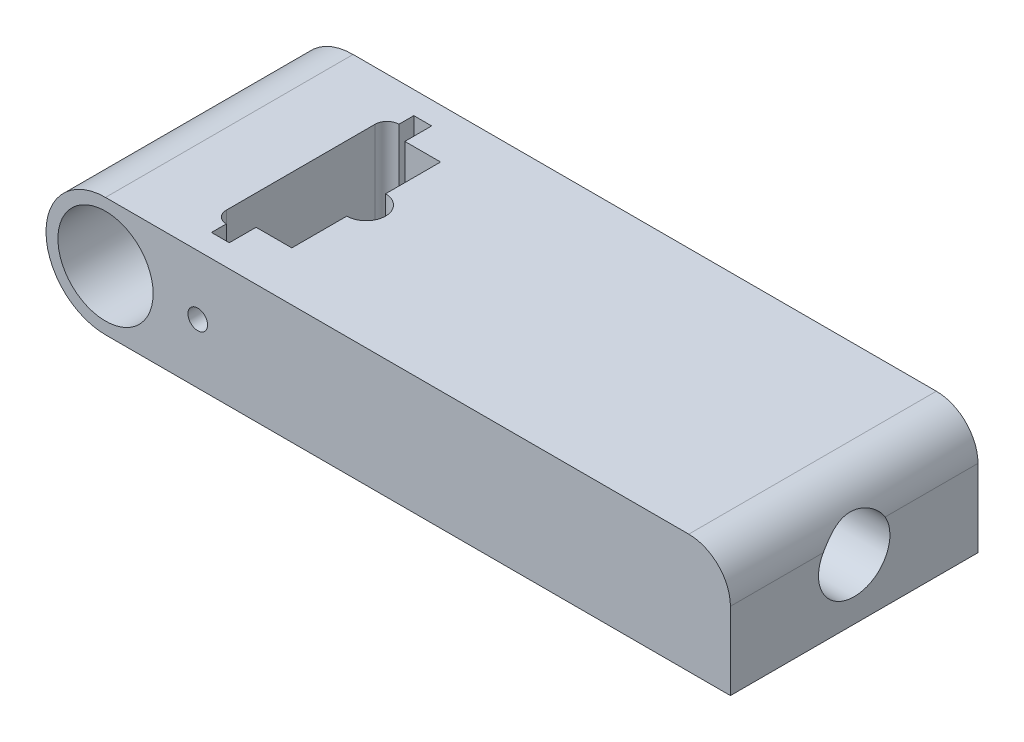
ISO-10303-21;
HEADER;
FILE_DESCRIPTION(('STEP AP214'),'2;1');
FILE_NAME('part.step','',(''),(''),'','','');
FILE_SCHEMA(('AUTOMOTIVE_DESIGN { 1 0 10303 214 1 1 1 1 }'));
ENDSEC;
DATA;
#1=APPLICATION_CONTEXT('core data for automotive mechanical design processes');
#2=APPLICATION_PROTOCOL_DEFINITION('international standard','automotive_design',2000,#1);
#3=PRODUCT_CONTEXT('',#1,'mechanical');
#4=PRODUCT('Part','Part','',(#3));
#5=PRODUCT_RELATED_PRODUCT_CATEGORY('part','',(#4));
#6=PRODUCT_DEFINITION_FORMATION('','',#4);
#7=PRODUCT_DEFINITION_CONTEXT('part definition',#1,'design');
#8=PRODUCT_DEFINITION('design','',#6,#7);
#9=PRODUCT_DEFINITION_SHAPE('','',#8);
#10=(LENGTH_UNIT() NAMED_UNIT(*) SI_UNIT(.MILLI.,.METRE.));
#11=(NAMED_UNIT(*) PLANE_ANGLE_UNIT() SI_UNIT($,.RADIAN.));
#12=(NAMED_UNIT(*) SI_UNIT($,.STERADIAN.) SOLID_ANGLE_UNIT());
#13=UNCERTAINTY_MEASURE_WITH_UNIT(LENGTH_MEASURE(1.E-05),#10,'distance_accuracy_value','');
#14=(GEOMETRIC_REPRESENTATION_CONTEXT(3) GLOBAL_UNCERTAINTY_ASSIGNED_CONTEXT((#13)) GLOBAL_UNIT_ASSIGNED_CONTEXT((#10,
#11,#12)) REPRESENTATION_CONTEXT('',''));
#15=CARTESIAN_POINT('',(0.,0.,0.));
#16=DIRECTION('',(0.,0.,1.));
#17=DIRECTION('',(1.,0.,0.));
#18=AXIS2_PLACEMENT_3D('',#15,#16,#17);
#19=CARTESIAN_POINT('',(14.,-10.,-17.));
#20=DIRECTION('',(0.,0.,-1.));
#21=DIRECTION('',(-1.,0.,0.));
#22=AXIS2_PLACEMENT_3D('',#19,#20,#21);
#23=PLANE('',#22);
#24=DIRECTION('',(0.,1.,0.));
#25=VECTOR('',#24,1.);
#26=CARTESIAN_POINT('',(14.,-10.,-17.));
#27=LINE('',#26,#25);
#28=CARTESIAN_POINT('',(14.,0.687386354243315,-17.));
#29=VERTEX_POINT('',#28);
#30=CARTESIAN_POINT('',(14.,10.,-17.));
#31=VERTEX_POINT('',#30);
#32=EDGE_CURVE('E403',#29,#31,#27,.T.);
#33=ORIENTED_EDGE('',*,*,#32,.F.);
#34=CARTESIAN_POINT('',(15.5,0.,-17.));
#35=DIRECTION('',(0.,0.,-1.));
#36=DIRECTION('',(-1.,0.,0.));
#37=AXIS2_PLACEMENT_3D('',#34,#35,#36);
#38=CIRCLE('',#37,1.64999999999999);
#39=CARTESIAN_POINT('',(17.,0.687386354243375,-17.));
#40=VERTEX_POINT('',#39);
#41=EDGE_CURVE('E404',#29,#40,#38,.T.);
#42=ORIENTED_EDGE('',*,*,#41,.T.);
#43=DIRECTION('',(0.,1.,0.));
#44=VECTOR('',#43,1.);
#45=CARTESIAN_POINT('',(17.,-10.,-17.));
#46=LINE('',#45,#44);
#47=CARTESIAN_POINT('',(17.,10.,-17.));
#48=VERTEX_POINT('',#47);
#49=EDGE_CURVE('E417',#40,#48,#46,.T.);
#50=ORIENTED_EDGE('',*,*,#49,.T.);
#51=DIRECTION('',(-1.,0.,0.));
#52=VECTOR('',#51,1.);
#53=CARTESIAN_POINT('',(14.,10.,-17.));
#54=LINE('',#53,#52);
#55=EDGE_CURVE('E407',#48,#31,#54,.T.);
#56=ORIENTED_EDGE('',*,*,#55,.T.);
#57=EDGE_LOOP('',(#33,#42,#50,#56));
#58=FACE_BOUND('',#57,.T.);
#59=ADVANCED_FACE('F38',(#58),#23,.F.);
#60=CARTESIAN_POINT('',(17.,-10.,-17.));
#61=DIRECTION('',(1.,0.,0.));
#62=DIRECTION('',(0.,0.,-1.));
#63=AXIS2_PLACEMENT_3D('',#60,#61,#62);
#64=PLANE('',#63);
#65=DIRECTION('',(0.,1.,0.));
#66=VECTOR('',#65,1.);
#67=CARTESIAN_POINT('',(17.,-10.,-12.5));
#68=LINE('',#67,#66);
#69=CARTESIAN_POINT('',(17.,-10.,-12.5));
#70=VERTEX_POINT('',#69);
#71=CARTESIAN_POINT('',(17.,-0.687386354243375,-12.5));
#72=VERTEX_POINT('',#71);
#73=EDGE_CURVE('E423',#70,#72,#68,.T.);
#74=ORIENTED_EDGE('',*,*,#73,.T.);
#75=DIRECTION('',(0.,0.,-1.));
#76=VECTOR('',#75,1.);
#77=CARTESIAN_POINT('',(17.,-0.687386354243375,-20.8));
#78=LINE('',#77,#76);
#79=CARTESIAN_POINT('',(17.,-0.687386354243375,-17.));
#80=VERTEX_POINT('',#79);
#81=EDGE_CURVE('E802',#72,#80,#78,.T.);
#82=ORIENTED_EDGE('',*,*,#81,.T.);
#83=CARTESIAN_POINT('',(17.,-10.,-17.));
#84=VERTEX_POINT('',#83);
#85=EDGE_CURVE('E412',#84,#80,#46,.T.);
#86=ORIENTED_EDGE('',*,*,#85,.F.);
#87=DIRECTION('',(0.,0.,-1.));
#88=VECTOR('',#87,1.);
#89=CARTESIAN_POINT('',(17.,-10.,-17.));
#90=LINE('',#89,#88);
#91=EDGE_CURVE('E510',#70,#84,#90,.T.);
#92=ORIENTED_EDGE('',*,*,#91,.F.);
#93=EDGE_LOOP('',(#74,#82,#86,#92));
#94=FACE_BOUND('',#93,.T.);
#95=ADVANCED_FACE('F361',(#94),#64,.F.);
#96=CARTESIAN_POINT('',(0.,0.,-20.8));
#97=DIRECTION('',(0.,0.,1.));
#98=DIRECTION('',(1.,0.,0.));
#99=AXIS2_PLACEMENT_3D('',#96,#97,#98);
#100=PLANE('',#99);
#101=DIRECTION('',(-1.,0.,0.));
#102=VECTOR('',#101,1.);
#103=CARTESIAN_POINT('',(0.,10.,-20.8));
#104=LINE('',#103,#102);
#105=CARTESIAN_POINT('',(98.,10.,-20.8));
#106=VERTEX_POINT('',#105);
#107=CARTESIAN_POINT('',(0.,10.,-20.8));
#108=VERTEX_POINT('',#107);
#109=EDGE_CURVE('E272',#106,#108,#104,.T.);
#110=ORIENTED_EDGE('',*,*,#109,.F.);
#111=CARTESIAN_POINT('',(98.,3.,-20.8));
#112=DIRECTION('',(0.,0.,1.));
#113=DIRECTION('',(1.,0.,0.));
#114=AXIS2_PLACEMENT_3D('',#111,#112,#113);
#115=CIRCLE('',#114,7.);
#116=CARTESIAN_POINT('',(105.,3.,-20.8));
#117=VERTEX_POINT('',#116);
#118=EDGE_CURVE('E299',#106,#117,#115,.F.);
#119=ORIENTED_EDGE('',*,*,#118,.T.);
#120=DIRECTION('',(0.,1.,0.));
#121=VECTOR('',#120,1.);
#122=CARTESIAN_POINT('',(105.,10.,-20.8));
#123=LINE('',#122,#121);
#124=CARTESIAN_POINT('',(105.,-10.,-20.8));
#125=VERTEX_POINT('',#124);
#126=EDGE_CURVE('E284',#125,#117,#123,.T.);
#127=ORIENTED_EDGE('',*,*,#126,.F.);
#128=DIRECTION('',(1.,0.,0.));
#129=VECTOR('',#128,1.);
#130=CARTESIAN_POINT('',(0.,-10.,-20.8));
#131=LINE('',#130,#129);
#132=CARTESIAN_POINT('',(0.,-10.,-20.8));
#133=VERTEX_POINT('',#132);
#134=EDGE_CURVE('E282',#133,#125,#131,.T.);
#135=ORIENTED_EDGE('',*,*,#134,.F.);
#136=CARTESIAN_POINT('',(0.,0.,-20.8));
#137=DIRECTION('',(0.,0.,1.));
#138=DIRECTION('',(1.,0.,0.));
#139=AXIS2_PLACEMENT_3D('',#136,#137,#138);
#140=CIRCLE('',#139,10.);
#141=EDGE_CURVE('E265',#108,#133,#140,.T.);
#142=ORIENTED_EDGE('',*,*,#141,.F.);
#143=EDGE_LOOP('',(#110,#119,#127,#135,#142));
#144=FACE_BOUND('',#143,.T.);
#145=CARTESIAN_POINT('',(0.,0.,-20.8));
#146=DIRECTION('',(0.,0.,1.));
#147=DIRECTION('',(1.,0.,0.));
#148=AXIS2_PLACEMENT_3D('',#145,#146,#147);
#149=CIRCLE('',#148,8.);
#150=CARTESIAN_POINT('',(8.,0.,-20.8));
#151=VERTEX_POINT('',#150);
#152=EDGE_CURVE('E260',#151,#151,#149,.T.);
#153=ORIENTED_EDGE('',*,*,#152,.T.);
#154=EDGE_LOOP('',(#153));
#155=FACE_BOUND('',#154,.T.);
#156=CARTESIAN_POINT('',(15.5,0.,-20.8));
#157=DIRECTION('',(0.,0.,-1.));
#158=DIRECTION('',(-1.,0.,0.));
#159=AXIS2_PLACEMENT_3D('',#156,#157,#158);
#160=CIRCLE('',#159,1.64999999999999);
#161=CARTESIAN_POINT('',(13.85,0.,-20.8));
#162=VERTEX_POINT('',#161);
#163=EDGE_CURVE('E777',#162,#162,#160,.T.);
#164=ORIENTED_EDGE('',*,*,#163,.F.);
#165=EDGE_LOOP('',(#164));
#166=FACE_BOUND('',#165,.T.);
#167=ADVANCED_FACE('F398',(#144,#155,#166),#100,.F.);
#168=CARTESIAN_POINT('',(17.,-10.,17.));
#169=DIRECTION('',(1.,0.,0.));
#170=DIRECTION('',(0.,0.,-1.));
#171=AXIS2_PLACEMENT_3D('',#168,#169,#170);
#172=PLANE('',#171);
#173=DIRECTION('',(0.,1.,0.));
#174=VECTOR('',#173,1.);
#175=CARTESIAN_POINT('',(17.,-10.,17.));
#176=LINE('',#175,#174);
#177=CARTESIAN_POINT('',(17.,-10.,17.));
#178=VERTEX_POINT('',#177);
#179=CARTESIAN_POINT('',(17.,-0.687386354243375,17.));
#180=VERTEX_POINT('',#179);
#181=EDGE_CURVE('E435',#178,#180,#176,.T.);
#182=ORIENTED_EDGE('',*,*,#181,.T.);
#183=DIRECTION('',(0.,0.,-1.));
#184=VECTOR('',#183,1.);
#185=CARTESIAN_POINT('',(17.,-0.687386354243375,-20.8));
#186=LINE('',#185,#184);
#187=CARTESIAN_POINT('',(17.,-0.687386354243375,12.5));
#188=VERTEX_POINT('',#187);
#189=EDGE_CURVE('E789',#180,#188,#186,.T.);
#190=ORIENTED_EDGE('',*,*,#189,.T.);
#191=DIRECTION('',(0.,1.,0.));
#192=VECTOR('',#191,1.);
#193=CARTESIAN_POINT('',(17.,-10.,12.5));
#194=LINE('',#193,#192);
#195=CARTESIAN_POINT('',(17.,-10.,12.5));
#196=VERTEX_POINT('',#195);
#197=EDGE_CURVE('E432',#196,#188,#194,.T.);
#198=ORIENTED_EDGE('',*,*,#197,.F.);
#199=DIRECTION('',(0.,0.,-1.));
#200=VECTOR('',#199,1.);
#201=CARTESIAN_POINT('',(17.,-10.,17.));
#202=LINE('',#201,#200);
#203=EDGE_CURVE('E498',#178,#196,#202,.T.);
#204=ORIENTED_EDGE('',*,*,#203,.F.);
#205=EDGE_LOOP('',(#182,#190,#198,#204));
#206=FACE_BOUND('',#205,.T.);
#207=ADVANCED_FACE('F378',(#206),#172,.F.);
#208=CARTESIAN_POINT('',(14.,-10.,-14.5));
#209=DIRECTION('',(-1.,0.,0.));
#210=DIRECTION('',(0.,0.,1.));
#211=AXIS2_PLACEMENT_3D('',#208,#209,#210);
#212=PLANE('',#211);
#213=DIRECTION('',(0.,1.,0.));
#214=VECTOR('',#213,1.);
#215=CARTESIAN_POINT('',(14.,-10.,-14.5));
#216=LINE('',#215,#214);
#217=CARTESIAN_POINT('',(14.,0.687386354243315,-14.5));
#218=VERTEX_POINT('',#217);
#219=CARTESIAN_POINT('',(14.,10.,-14.5));
#220=VERTEX_POINT('',#219);
#221=EDGE_CURVE('E415',#218,#220,#216,.T.);
#222=ORIENTED_EDGE('',*,*,#221,.F.);
#223=DIRECTION('',(0.,0.,-1.));
#224=VECTOR('',#223,1.);
#225=CARTESIAN_POINT('',(14.,0.687386354243315,-20.8));
#226=LINE('',#225,#224);
#227=EDGE_CURVE('E59',#218,#29,#226,.T.);
#228=ORIENTED_EDGE('',*,*,#227,.T.);
#229=ORIENTED_EDGE('',*,*,#32,.T.);
#230=DIRECTION('',(0.,0.,1.));
#231=VECTOR('',#230,1.);
#232=CARTESIAN_POINT('',(14.,10.,-14.5));
#233=LINE('',#232,#231);
#234=EDGE_CURVE('E478',#31,#220,#233,.T.);
#235=ORIENTED_EDGE('',*,*,#234,.T.);
#236=EDGE_LOOP('',(#222,#228,#229,#235));
#237=FACE_BOUND('',#236,.T.);
#238=ADVANCED_FACE('F352',(#237),#212,.F.);
#239=CARTESIAN_POINT('',(14.,-10.,17.));
#240=DIRECTION('',(0.,0.,1.));
#241=DIRECTION('',(1.,0.,0.));
#242=AXIS2_PLACEMENT_3D('',#239,#240,#241);
#243=PLANE('',#242);
#244=CARTESIAN_POINT('',(17.,0.687386354243375,17.));
#245=VERTEX_POINT('',#244);
#246=CARTESIAN_POINT('',(17.,10.,17.));
#247=VERTEX_POINT('',#246);
#248=EDGE_CURVE('E437',#245,#247,#176,.T.);
#249=ORIENTED_EDGE('',*,*,#248,.F.);
#250=CARTESIAN_POINT('',(15.5,0.,17.));
#251=DIRECTION('',(0.,0.,1.));
#252=DIRECTION('',(1.,0.,0.));
#253=AXIS2_PLACEMENT_3D('',#250,#251,#252);
#254=CIRCLE('',#253,1.64999999999999);
#255=CARTESIAN_POINT('',(14.,0.687386354243315,17.));
#256=VERTEX_POINT('',#255);
#257=EDGE_CURVE('E452',#245,#256,#254,.T.);
#258=ORIENTED_EDGE('',*,*,#257,.T.);
#259=DIRECTION('',(0.,1.,0.));
#260=VECTOR('',#259,1.);
#261=CARTESIAN_POINT('',(14.,-10.,17.));
#262=LINE('',#261,#260);
#263=CARTESIAN_POINT('',(14.,10.,17.));
#264=VERTEX_POINT('',#263);
#265=EDGE_CURVE('E238',#256,#264,#262,.T.);
#266=ORIENTED_EDGE('',*,*,#265,.T.);
#267=DIRECTION('',(1.,0.,0.));
#268=VECTOR('',#267,1.);
#269=CARTESIAN_POINT('',(14.,10.,17.));
#270=LINE('',#269,#268);
#271=EDGE_CURVE('E450',#264,#247,#270,.T.);
#272=ORIENTED_EDGE('',*,*,#271,.T.);
#273=EDGE_LOOP('',(#249,#258,#266,#272));
#274=FACE_BOUND('',#273,.T.);
#275=ADVANCED_FACE('F383',(#274),#243,.F.);
#276=CARTESIAN_POINT('',(14.,-10.,14.5));
#277=DIRECTION('',(-1.,0.,0.));
#278=DIRECTION('',(0.,0.,1.));
#279=AXIS2_PLACEMENT_3D('',#276,#277,#278);
#280=PLANE('',#279);
#281=ORIENTED_EDGE('',*,*,#265,.F.);
#282=DIRECTION('',(0.,0.,-1.));
#283=VECTOR('',#282,1.);
#284=CARTESIAN_POINT('',(14.,0.687386354243315,-20.8));
#285=LINE('',#284,#283);
#286=CARTESIAN_POINT('',(14.,0.687386354243315,14.5));
#287=VERTEX_POINT('',#286);
#288=EDGE_CURVE('E227',#256,#287,#285,.T.);
#289=ORIENTED_EDGE('',*,*,#288,.T.);
#290=DIRECTION('',(0.,1.,0.));
#291=VECTOR('',#290,1.);
#292=CARTESIAN_POINT('',(14.,-10.,14.5));
#293=LINE('',#292,#291);
#294=CARTESIAN_POINT('',(14.,10.,14.5));
#295=VERTEX_POINT('',#294);
#296=EDGE_CURVE('E236',#287,#295,#293,.T.);
#297=ORIENTED_EDGE('',*,*,#296,.T.);
#298=DIRECTION('',(0.,0.,1.));
#299=VECTOR('',#298,1.);
#300=CARTESIAN_POINT('',(14.,10.,14.5));
#301=LINE('',#300,#299);
#302=EDGE_CURVE('E453',#295,#264,#301,.T.);
#303=ORIENTED_EDGE('',*,*,#302,.T.);
#304=EDGE_LOOP('',(#281,#289,#297,#303));
#305=FACE_BOUND('',#304,.T.);
#306=ADVANCED_FACE('F234',(#305),#280,.F.);
#307=CARTESIAN_POINT('',(0.,0.,20.8));
#308=DIRECTION('',(0.,0.,1.));
#309=DIRECTION('',(1.,0.,0.));
#310=AXIS2_PLACEMENT_3D('',#307,#308,#309);
#311=PLANE('',#310);
#312=CARTESIAN_POINT('',(15.5,0.,20.8));
#313=DIRECTION('',(0.,0.,-1.));
#314=DIRECTION('',(-1.,0.,0.));
#315=AXIS2_PLACEMENT_3D('',#312,#313,#314);
#316=CIRCLE('',#315,1.64999999999999);
#317=CARTESIAN_POINT('',(13.85,0.,20.8));
#318=VERTEX_POINT('',#317);
#319=EDGE_CURVE('E778',#318,#318,#316,.T.);
#320=ORIENTED_EDGE('',*,*,#319,.T.);
#321=EDGE_LOOP('',(#320));
#322=FACE_BOUND('',#321,.T.);
#323=DIRECTION('',(0.,1.,0.));
#324=VECTOR('',#323,1.);
#325=CARTESIAN_POINT('',(105.,10.,20.8));
#326=LINE('',#325,#324);
#327=CARTESIAN_POINT('',(105.,-10.,20.8));
#328=VERTEX_POINT('',#327);
#329=CARTESIAN_POINT('',(105.,3.,20.8));
#330=VERTEX_POINT('',#329);
#331=EDGE_CURVE('E274',#328,#330,#326,.T.);
#332=ORIENTED_EDGE('',*,*,#331,.T.);
#333=CARTESIAN_POINT('',(98.,3.,20.8));
#334=DIRECTION('',(0.,0.,1.));
#335=DIRECTION('',(1.,0.,0.));
#336=AXIS2_PLACEMENT_3D('',#333,#334,#335);
#337=CIRCLE('',#336,7.);
#338=CARTESIAN_POINT('',(98.,10.,20.8));
#339=VERTEX_POINT('',#338);
#340=EDGE_CURVE('E311',#330,#339,#337,.T.);
#341=ORIENTED_EDGE('',*,*,#340,.T.);
#342=DIRECTION('',(-1.,0.,0.));
#343=VECTOR('',#342,1.);
#344=CARTESIAN_POINT('',(0.,10.,20.8));
#345=LINE('',#344,#343);
#346=CARTESIAN_POINT('',(0.,10.,20.8));
#347=VERTEX_POINT('',#346);
#348=EDGE_CURVE('E277',#339,#347,#345,.T.);
#349=ORIENTED_EDGE('',*,*,#348,.T.);
#350=CARTESIAN_POINT('',(0.,0.,20.8));
#351=DIRECTION('',(0.,0.,1.));
#352=DIRECTION('',(1.,0.,0.));
#353=AXIS2_PLACEMENT_3D('',#350,#351,#352);
#354=CIRCLE('',#353,10.);
#355=CARTESIAN_POINT('',(0.,-10.,20.8));
#356=VERTEX_POINT('',#355);
#357=EDGE_CURVE('E268',#347,#356,#354,.T.);
#358=ORIENTED_EDGE('',*,*,#357,.T.);
#359=DIRECTION('',(1.,0.,0.));
#360=VECTOR('',#359,1.);
#361=CARTESIAN_POINT('',(0.,-10.,20.8));
#362=LINE('',#361,#360);
#363=EDGE_CURVE('E271',#356,#328,#362,.T.);
#364=ORIENTED_EDGE('',*,*,#363,.T.);
#365=EDGE_LOOP('',(#332,#341,#349,#358,#364));
#366=FACE_BOUND('',#365,.T.);
#367=CARTESIAN_POINT('',(0.,0.,20.8));
#368=DIRECTION('',(0.,0.,1.));
#369=DIRECTION('',(1.,0.,0.));
#370=AXIS2_PLACEMENT_3D('',#367,#368,#369);
#371=CIRCLE('',#370,8.);
#372=CARTESIAN_POINT('',(8.,0.,20.8));
#373=VERTEX_POINT('',#372);
#374=EDGE_CURVE('E262',#373,#373,#371,.T.);
#375=ORIENTED_EDGE('',*,*,#374,.F.);
#376=EDGE_LOOP('',(#375));
#377=FACE_BOUND('',#376,.T.);
#378=ADVANCED_FACE('F555',(#322,#366,#377),#311,.T.);
#379=CARTESIAN_POINT('',(0.,0.,20.8));
#380=DIRECTION('',(0.,0.,-1.));
#381=DIRECTION('',(-1.,0.,0.));
#382=AXIS2_PLACEMENT_3D('',#379,#380,#381);
#383=CYLINDRICAL_SURFACE('',#382,10.);
#384=ORIENTED_EDGE('',*,*,#141,.T.);
#385=DIRECTION('',(0.,0.,-1.));
#386=VECTOR('',#385,1.);
#387=CARTESIAN_POINT('',(0.,-10.,20.8));
#388=LINE('',#387,#386);
#389=EDGE_CURVE('E293',#356,#133,#388,.T.);
#390=ORIENTED_EDGE('',*,*,#389,.F.);
#391=ORIENTED_EDGE('',*,*,#357,.F.);
#392=DIRECTION('',(0.,0.,-1.));
#393=VECTOR('',#392,1.);
#394=CARTESIAN_POINT('',(0.,10.,20.8));
#395=LINE('',#394,#393);
#396=EDGE_CURVE('E279',#347,#108,#395,.T.);
#397=ORIENTED_EDGE('',*,*,#396,.T.);
#398=EDGE_LOOP('',(#384,#390,#391,#397));
#399=FACE_BOUND('',#398,.T.);
#400=ADVANCED_FACE('F568',(#399),#383,.T.);
#401=CARTESIAN_POINT('',(0.,-10.,20.8));
#402=DIRECTION('',(0.,1.,0.));
#403=DIRECTION('',(0.,0.,1.));
#404=AXIS2_PLACEMENT_3D('',#401,#402,#403);
#405=PLANE('',#404);
#406=DIRECTION('',(0.,0.,1.));
#407=VECTOR('',#406,1.);
#408=CARTESIAN_POINT('',(14.,-10.,-14.5));
#409=LINE('',#408,#407);
#410=CARTESIAN_POINT('',(14.,-10.,-17.));
#411=VERTEX_POINT('',#410);
#412=CARTESIAN_POINT('',(14.,-10.,-14.5));
#413=VERTEX_POINT('',#412);
#414=EDGE_CURVE('E256',#411,#413,#409,.T.);
#415=ORIENTED_EDGE('',*,*,#414,.T.);
#416=CARTESIAN_POINT('',(14.,-10.,-12.5));
#417=DIRECTION('',(0.,1.,0.));
#418=DIRECTION('',(0.,0.,-1.));
#419=AXIS2_PLACEMENT_3D('',#416,#417,#418);
#420=CIRCLE('',#419,2.);
#421=CARTESIAN_POINT('',(12.,-10.,-12.5));
#422=VERTEX_POINT('',#421);
#423=EDGE_CURVE('E337',#413,#422,#420,.T.);
#424=ORIENTED_EDGE('',*,*,#423,.T.);
#425=DIRECTION('',(0.,0.,1.));
#426=VECTOR('',#425,1.);
#427=CARTESIAN_POINT('',(12.,-10.,12.5));
#428=LINE('',#427,#426);
#429=CARTESIAN_POINT('',(12.,-10.,12.5));
#430=VERTEX_POINT('',#429);
#431=EDGE_CURVE('E482',#422,#430,#428,.T.);
#432=ORIENTED_EDGE('',*,*,#431,.T.);
#433=CARTESIAN_POINT('',(14.,-10.,12.5));
#434=DIRECTION('',(0.,1.,0.));
#435=DIRECTION('',(0.,0.,1.));
#436=AXIS2_PLACEMENT_3D('',#433,#434,#435);
#437=CIRCLE('',#436,2.);
#438=CARTESIAN_POINT('',(14.,-10.,14.5));
#439=VERTEX_POINT('',#438);
#440=EDGE_CURVE('E487',#430,#439,#437,.T.);
#441=ORIENTED_EDGE('',*,*,#440,.T.);
#442=DIRECTION('',(0.,0.,1.));
#443=VECTOR('',#442,1.);
#444=CARTESIAN_POINT('',(14.,-10.,14.5));
#445=LINE('',#444,#443);
#446=CARTESIAN_POINT('',(14.,-10.,17.));
#447=VERTEX_POINT('',#446);
#448=EDGE_CURVE('E490',#439,#447,#445,.T.);
#449=ORIENTED_EDGE('',*,*,#448,.T.);
#450=DIRECTION('',(1.,0.,0.));
#451=VECTOR('',#450,1.);
#452=CARTESIAN_POINT('',(14.,-10.,17.));
#453=LINE('',#452,#451);
#454=EDGE_CURVE('E495',#447,#178,#453,.T.);
#455=ORIENTED_EDGE('',*,*,#454,.T.);
#456=ORIENTED_EDGE('',*,*,#203,.T.);
#457=DIRECTION('',(1.,0.,0.));
#458=VECTOR('',#457,1.);
#459=CARTESIAN_POINT('',(17.,-10.,12.5));
#460=LINE('',#459,#458);
#461=CARTESIAN_POINT('',(23.,-10.,12.5));
#462=VERTEX_POINT('',#461);
#463=EDGE_CURVE('E501',#196,#462,#460,.T.);
#464=ORIENTED_EDGE('',*,*,#463,.T.);
#465=DIRECTION('',(0.,0.,-1.));
#466=VECTOR('',#465,1.);
#467=CARTESIAN_POINT('',(23.,-10.,-12.5));
#468=LINE('',#467,#466);
#469=CARTESIAN_POINT('',(23.,-10.,-12.5));
#470=VERTEX_POINT('',#469);
#471=EDGE_CURVE('E504',#462,#470,#468,.T.);
#472=ORIENTED_EDGE('',*,*,#471,.T.);
#473=DIRECTION('',(-1.,0.,0.));
#474=VECTOR('',#473,1.);
#475=CARTESIAN_POINT('',(17.,-10.,-12.5));
#476=LINE('',#475,#474);
#477=EDGE_CURVE('E507',#470,#70,#476,.T.);
#478=ORIENTED_EDGE('',*,*,#477,.T.);
#479=ORIENTED_EDGE('',*,*,#91,.T.);
#480=DIRECTION('',(-1.,0.,0.));
#481=VECTOR('',#480,1.);
#482=CARTESIAN_POINT('',(14.,-10.,-17.));
#483=LINE('',#482,#481);
#484=EDGE_CURVE('E513',#84,#411,#483,.T.);
#485=ORIENTED_EDGE('',*,*,#484,.T.);
#486=EDGE_LOOP('',(#415,#424,#432,#441,#449,#455,#456,#464,#472,#478,#479,#485));
#487=FACE_BOUND('',#486,.T.);
#488=ORIENTED_EDGE('',*,*,#134,.T.);
#489=DIRECTION('',(0.,0.,-1.));
#490=VECTOR('',#489,1.);
#491=CARTESIAN_POINT('',(105.,-10.,20.8));
#492=LINE('',#491,#490);
#493=EDGE_CURVE('E290',#328,#125,#492,.T.);
#494=ORIENTED_EDGE('',*,*,#493,.F.);
#495=ORIENTED_EDGE('',*,*,#363,.F.);
#496=ORIENTED_EDGE('',*,*,#389,.T.);
#497=EDGE_LOOP('',(#488,#494,#495,#496));
#498=FACE_BOUND('',#497,.T.);
#499=ADVANCED_FACE('F539',(#487,#498),#405,.F.);
#500=CARTESIAN_POINT('',(105.,10.,20.8));
#501=DIRECTION('',(-1.,0.,0.));
#502=DIRECTION('',(0.,0.,1.));
#503=AXIS2_PLACEMENT_3D('',#500,#501,#502);
#504=PLANE('',#503);
#505=ORIENTED_EDGE('',*,*,#126,.T.);
#506=DIRECTION('',(0.,0.,-1.));
#507=VECTOR('',#506,1.);
#508=CARTESIAN_POINT('',(105.,3.,20.8));
#509=LINE('',#508,#507);
#510=CARTESIAN_POINT('',(105.,3.,-5.19615242270663));
#511=VERTEX_POINT('',#510);
#512=EDGE_CURVE('E303',#117,#511,#509,.F.);
#513=ORIENTED_EDGE('',*,*,#512,.T.);
#514=CARTESIAN_POINT('',(105.,0.,0.));
#515=DIRECTION('',(1.,0.,0.));
#516=DIRECTION('',(0.,0.,-1.));
#517=AXIS2_PLACEMENT_3D('',#514,#515,#516);
#518=CIRCLE('',#517,6.);
#519=CARTESIAN_POINT('',(105.,3.,5.19615242270663));
#520=VERTEX_POINT('',#519);
#521=EDGE_CURVE('E257',#520,#511,#518,.T.);
#522=ORIENTED_EDGE('',*,*,#521,.F.);
#523=DIRECTION('',(0.,0.,-1.));
#524=VECTOR('',#523,1.);
#525=CARTESIAN_POINT('',(105.,3.,20.8));
#526=LINE('',#525,#524);
#527=EDGE_CURVE('E301',#520,#330,#526,.F.);
#528=ORIENTED_EDGE('',*,*,#527,.T.);
#529=ORIENTED_EDGE('',*,*,#331,.F.);
#530=ORIENTED_EDGE('',*,*,#493,.T.);
#531=EDGE_LOOP('',(#505,#513,#522,#528,#529,#530));
#532=FACE_BOUND('',#531,.T.);
#533=ADVANCED_FACE('F553',(#532),#504,.F.);
#534=CARTESIAN_POINT('',(0.,10.,20.8));
#535=DIRECTION('',(0.,-1.,0.));
#536=DIRECTION('',(0.,0.,-1.));
#537=AXIS2_PLACEMENT_3D('',#534,#535,#536);
#538=PLANE('',#537);
#539=DIRECTION('',(0.,0.,-1.));
#540=VECTOR('',#539,1.);
#541=CARTESIAN_POINT('',(23.,10.,-12.5));
#542=LINE('',#541,#540);
#543=CARTESIAN_POINT('',(23.,10.,-3.25));
#544=VERTEX_POINT('',#543);
#545=CARTESIAN_POINT('',(23.,10.,-12.5));
#546=VERTEX_POINT('',#545);
#547=EDGE_CURVE('E468',#544,#546,#542,.T.);
#548=ORIENTED_EDGE('',*,*,#547,.F.);
#549=CARTESIAN_POINT('',(23.,10.,0.));
#550=DIRECTION('',(0.,1.,0.));
#551=DIRECTION('',(0.,0.,1.));
#552=AXIS2_PLACEMENT_3D('',#549,#550,#551);
#553=CIRCLE('',#552,3.25);
#554=CARTESIAN_POINT('',(23.,10.,3.25));
#555=VERTEX_POINT('',#554);
#556=EDGE_CURVE('E335',#555,#544,#553,.T.);
#557=ORIENTED_EDGE('',*,*,#556,.F.);
#558=CARTESIAN_POINT('',(23.,10.,12.5));
#559=VERTEX_POINT('',#558);
#560=EDGE_CURVE('E469',#559,#555,#542,.T.);
#561=ORIENTED_EDGE('',*,*,#560,.F.);
#562=DIRECTION('',(1.,0.,0.));
#563=VECTOR('',#562,1.);
#564=CARTESIAN_POINT('',(17.,10.,12.5));
#565=LINE('',#564,#563);
#566=CARTESIAN_POINT('',(17.,10.,12.5));
#567=VERTEX_POINT('',#566);
#568=EDGE_CURVE('E462',#567,#559,#565,.T.);
#569=ORIENTED_EDGE('',*,*,#568,.F.);
#570=DIRECTION('',(0.,0.,-1.));
#571=VECTOR('',#570,1.);
#572=CARTESIAN_POINT('',(17.,10.,17.));
#573=LINE('',#572,#571);
#574=EDGE_CURVE('E460',#247,#567,#573,.T.);
#575=ORIENTED_EDGE('',*,*,#574,.F.);
#576=ORIENTED_EDGE('',*,*,#271,.F.);
#577=ORIENTED_EDGE('',*,*,#302,.F.);
#578=CARTESIAN_POINT('',(14.,10.,12.5));
#579=DIRECTION('',(0.,1.,0.));
#580=DIRECTION('',(0.,0.,1.));
#581=AXIS2_PLACEMENT_3D('',#578,#579,#580);
#582=CIRCLE('',#581,2.);
#583=CARTESIAN_POINT('',(12.,10.,12.5));
#584=VERTEX_POINT('',#583);
#585=EDGE_CURVE('E243',#584,#295,#582,.T.);
#586=ORIENTED_EDGE('',*,*,#585,.F.);
#587=DIRECTION('',(0.,0.,1.));
#588=VECTOR('',#587,1.);
#589=CARTESIAN_POINT('',(12.,10.,12.5));
#590=LINE('',#589,#588);
#591=CARTESIAN_POINT('',(12.,10.,-12.5));
#592=VERTEX_POINT('',#591);
#593=EDGE_CURVE('E518',#592,#584,#590,.T.);
#594=ORIENTED_EDGE('',*,*,#593,.F.);
#595=CARTESIAN_POINT('',(14.,10.,-12.5));
#596=DIRECTION('',(0.,1.,0.));
#597=DIRECTION('',(0.,0.,-1.));
#598=AXIS2_PLACEMENT_3D('',#595,#596,#597);
#599=CIRCLE('',#598,2.);
#600=EDGE_CURVE('E334',#220,#592,#599,.T.);
#601=ORIENTED_EDGE('',*,*,#600,.F.);
#602=ORIENTED_EDGE('',*,*,#234,.F.);
#603=ORIENTED_EDGE('',*,*,#55,.F.);
#604=DIRECTION('',(0.,0.,-1.));
#605=VECTOR('',#604,1.);
#606=CARTESIAN_POINT('',(17.,10.,-17.));
#607=LINE('',#606,#605);
#608=CARTESIAN_POINT('',(17.,10.,-12.5));
#609=VERTEX_POINT('',#608);
#610=EDGE_CURVE('E475',#609,#48,#607,.T.);
#611=ORIENTED_EDGE('',*,*,#610,.F.);
#612=DIRECTION('',(-1.,0.,0.));
#613=VECTOR('',#612,1.);
#614=CARTESIAN_POINT('',(17.,10.,-12.5));
#615=LINE('',#614,#613);
#616=EDGE_CURVE('E472',#546,#609,#615,.T.);
#617=ORIENTED_EDGE('',*,*,#616,.F.);
#618=EDGE_LOOP('',(#548,#557,#561,#569,#575,#576,#577,#586,#594,#601,#602,#603,#611,#617));
#619=FACE_BOUND('',#618,.T.);
#620=ORIENTED_EDGE('',*,*,#348,.F.);
#621=DIRECTION('',(0.,0.,-1.));
#622=VECTOR('',#621,1.);
#623=CARTESIAN_POINT('',(98.,10.,20.8));
#624=LINE('',#623,#622);
#625=EDGE_CURVE('E296',#339,#106,#624,.T.);
#626=ORIENTED_EDGE('',*,*,#625,.T.);
#627=ORIENTED_EDGE('',*,*,#109,.T.);
#628=ORIENTED_EDGE('',*,*,#396,.F.);
#629=EDGE_LOOP('',(#620,#626,#627,#628));
#630=FACE_BOUND('',#629,.T.);
#631=ADVANCED_FACE('F457',(#619,#630),#538,.F.);
#632=CARTESIAN_POINT('',(0.,0.,20.8));
#633=DIRECTION('',(0.,0.,-1.));
#634=DIRECTION('',(-1.,0.,0.));
#635=AXIS2_PLACEMENT_3D('',#632,#633,#634);
#636=CYLINDRICAL_SURFACE('',#635,8.);
#637=ORIENTED_EDGE('',*,*,#374,.T.);
#638=EDGE_LOOP('',(#637));
#639=FACE_BOUND('',#638,.T.);
#640=ORIENTED_EDGE('',*,*,#152,.F.);
#641=EDGE_LOOP('',(#640));
#642=FACE_BOUND('',#641,.T.);
#643=ADVANCED_FACE('F318',(#639,#642),#636,.F.);
#644=CARTESIAN_POINT('',(105.,0.,0.));
#645=DIRECTION('',(1.,0.,0.));
#646=DIRECTION('',(0.,0.,-1.));
#647=AXIS2_PLACEMENT_3D('',#644,#645,#646);
#648=CYLINDRICAL_SURFACE('',#647,5.99999999999999);
#649=CARTESIAN_POINT('',(23.,0.,0.));
#650=DIRECTION('',(1.,0.,0.));
#651=DIRECTION('',(0.,0.,-1.));
#652=AXIS2_PLACEMENT_3D('',#649,#650,#651);
#653=CIRCLE('',#652,5.99999999999999);
#654=CARTESIAN_POINT('',(23.,5.04356025045799,-3.25));
#655=VERTEX_POINT('',#654);
#656=CARTESIAN_POINT('',(23.,5.04356025045799,3.25));
#657=VERTEX_POINT('',#656);
#658=EDGE_CURVE('E261',#655,#657,#653,.F.);
#659=ORIENTED_EDGE('',*,*,#658,.T.);
#660=CARTESIAN_POINT('',(23.,5.04356025045799,3.25));
#661=CARTESIAN_POINT('',(23.0839731226874,5.04353157291162,3.250016497258));
#662=CARTESIAN_POINT('',(23.1679300010004,5.04565668085969,3.24674608287036));
#663=CARTESIAN_POINT('',(23.3350786996416,5.05399765158683,3.23376179024355));
#664=CARTESIAN_POINT('',(23.4182710429404,5.06021046812851,3.2240527101766));
#665=CARTESIAN_POINT('',(23.5827394398263,5.07645673368456,3.19840618294076));
#666=CARTESIAN_POINT('',(23.6640245282136,5.08646464264926,3.18251035264646));
#667=CARTESIAN_POINT('',(23.8246674911973,5.10991726184674,3.14471621780368));
#668=CARTESIAN_POINT('',(23.9040250833849,5.12336247241194,3.12281703937634));
#669=CARTESIAN_POINT('',(24.1380234343214,5.16810067040796,3.04861958182708));
#670=CARTESIAN_POINT('',(24.2891793810143,5.20385988321466,2.98772715141308));
#671=CARTESIAN_POINT('',(24.5792417600397,5.28317208052334,2.84512468234686));
#672=CARTESIAN_POINT('',(24.7181251012348,5.32673930859719,2.76337648068378));
#673=CARTESIAN_POINT('',(24.9943867400259,5.42186995447632,2.57211710043652));
#674=CARTESIAN_POINT('',(25.1303110911912,5.47379905927242,2.46068157843959));
#675=CARTESIAN_POINT('',(25.3826568226441,5.57685157239185,2.21725820729512));
#676=CARTESIAN_POINT('',(25.4990722215751,5.62797472927884,2.08526407881677));
#677=CARTESIAN_POINT('',(25.7186749198422,5.72873354073364,1.79098538281514));
#678=CARTESIAN_POINT('',(25.8199727000058,5.77789672968683,1.6270987096943));
#679=CARTESIAN_POINT('',(25.9496025982207,5.84262599668993,1.36810351507059));
#680=CARTESIAN_POINT('',(25.9891032874876,5.86270542969161,1.27954337235853));
#681=CARTESIAN_POINT('',(26.0602223304175,5.89928166602894,1.09861969848988));
#682=CARTESIAN_POINT('',(26.0918454129607,5.91578061793583,1.00625848808432));
#683=CARTESIAN_POINT('',(26.144553963823,5.94350575497499,0.826058165463501));
#684=CARTESIAN_POINT('',(26.1662839373028,5.9550500342034,0.738455745065635));
#685=CARTESIAN_POINT('',(26.2024222955199,5.97434303839326,0.561383061753386));
#686=CARTESIAN_POINT('',(26.2168344534036,5.98209371930137,0.471913786236634));
#687=CARTESIAN_POINT('',(26.2381371818242,5.99357573247718,0.291853976131992));
#688=CARTESIAN_POINT('',(26.2450305049806,5.99730853566943,0.201263864170421));
#689=CARTESIAN_POINT('',(26.2512099911779,6.00065548256863,0.0197777924008843));
#690=CARTESIAN_POINT('',(26.2504967315501,6.0002699388536,-0.0711181436718811));
#691=CARTESIAN_POINT('',(26.237843726654,5.99341645441413,-0.324585663894885));
#692=CARTESIAN_POINT('',(26.2174322839211,5.98235806905735,-0.486709361733622));
#693=CARTESIAN_POINT('',(26.1529873886525,5.9479498401234,-0.804705832281173));
#694=CARTESIAN_POINT('',(26.108952539462,5.92459926981352,-0.960578234817445));
#695=CARTESIAN_POINT('',(25.998471583198,5.86737381225591,-1.26414059817089));
#696=CARTESIAN_POINT('',(25.9317754630177,5.83338186689726,-1.41171688624174));
#697=CARTESIAN_POINT('',(25.7783279852481,5.757790696825,-1.69387784469705));
#698=CARTESIAN_POINT('',(25.6915699428658,5.7161889374281,-1.8284581634844));
#699=CARTESIAN_POINT('',(25.4900115174736,5.62394788908646,-2.09601584162161));
#700=CARTESIAN_POINT('',(25.3732170595378,5.57281814616759,-2.22732232829631));
#701=CARTESIAN_POINT('',(25.1201116883358,5.46982661128247,-2.46948476205465));
#702=CARTESIAN_POINT('',(24.9837780551623,5.41796403136148,-2.58031655314141));
#703=CARTESIAN_POINT('',(24.6816369186212,5.31446970757201,-2.7876395287815));
#704=CARTESIAN_POINT('',(24.5143137609554,5.26322579142495,-2.88213488421289));
#705=CARTESIAN_POINT('',(24.1630941724319,5.17317741278517,-3.0408278595957));
#706=CARTESIAN_POINT('',(23.9792458704267,5.13433823581827,-3.10511027236446));
#707=CARTESIAN_POINT('',(23.6619019701505,5.0852357745859,-3.18461571987173));
#708=CARTESIAN_POINT('',(23.5314774348532,5.06978691100378,-3.20899497646755));
#709=CARTESIAN_POINT('',(23.3335762590149,5.05414820367626,-3.23352345618848));
#710=CARTESIAN_POINT('',(23.2671003702038,5.0501907537778,-3.23969308046624));
#711=CARTESIAN_POINT('',(23.1337563094678,5.04489151787049,-3.24793467780956));
#712=CARTESIAN_POINT('',(23.0668879472002,5.04355112828386,-3.25000446327413));
#713=CARTESIAN_POINT('',(23.,5.04356025045799,-3.25));
#714=B_SPLINE_CURVE_WITH_KNOTS('',3,(#660,#661,#662,#663,#664,#665,#666,#667,#668,#669,#670,
#671,#672,#673,#674,#675,#676,#677,#678,#679,#680,#681,#682,#683,#684,#685,#686,#687,#688,#689,
#690,#691,#692,#693,#694,#695,#696,#697,#698,#699,#700,#701,#702,#703,#704,#705,#706,#707,#708,
#709,#710,#711,#712,#713),.UNSPECIFIED.,.F.,.F.,(4,2,2,2,2,2,2,2,2,2,2,2,2,2,2,2,2,2,2,2,2,2,2,
2,2,2,4),(0.,0.251802338888045,0.503417242148234,0.753368054253287,1.00335526984774,
1.50155100524129,2.00066498768788,2.54821414295123,3.09593086838639,3.68893291858253,
3.98564739852616,4.28218333097661,4.55478528239992,4.82724653415651,5.09960800527674,
5.37194880460735,5.8607314407459,6.34954297770497,6.84393261853108,7.33848723192408,
7.88528075441215,8.43271531920451,9.02628686457833,9.61818245087043,10.0175689890269,
10.2180431564165,10.4186242644673),.UNSPECIFIED.);
#715=EDGE_CURVE('E326',#657,#655,#714,.T.);
#716=ORIENTED_EDGE('',*,*,#715,.T.);
#717=EDGE_LOOP('',(#659,#716));
#718=FACE_BOUND('',#717,.T.);
#719=ORIENTED_EDGE('',*,*,#521,.T.);
#720=CARTESIAN_POINT('',(105.,3.,-5.19615242270663));
#721=CARTESIAN_POINT('',(105.000017814575,3.14084602025046,-5.11486741252274));
#722=CARTESIAN_POINT('',(104.995750405788,3.27829416234509,-5.02784712637433));
#723=CARTESIAN_POINT('',(104.980004119655,3.54528681149041,-4.84325934195347));
#724=CARTESIAN_POINT('',(104.968532537431,3.67483916859075,-4.74570259580605));
#725=CARTESIAN_POINT('',(104.939794355657,3.92467422839519,-4.54124503722784));
#726=CARTESIAN_POINT('',(104.922553288512,4.04499495040474,-4.43438690255801));
#727=CARTESIAN_POINT('',(104.883656493285,4.27633472549787,-4.21173780299965));
#728=CARTESIAN_POINT('',(104.861999674367,4.38735147061444,-4.09594463526729));
#729=CARTESIAN_POINT('',(104.815754939934,4.59912284326109,-3.85661971118168));
#730=CARTESIAN_POINT('',(104.791177495096,4.6999118637147,-3.73311631012097));
#731=CARTESIAN_POINT('',(104.740408634754,4.89121286422593,-3.47870221596451));
#732=CARTESIAN_POINT('',(104.714217147614,4.98172438762147,-3.34779119411142));
#733=CARTESIAN_POINT('',(104.661541525597,5.15216965277953,-3.07904252304856));
#734=CARTESIAN_POINT('',(104.635057027249,5.23208815559131,-2.94119528022376));
#735=CARTESIAN_POINT('',(104.583163541212,5.38079001375888,-2.65941334408741));
#736=CARTESIAN_POINT('',(104.557754625235,5.44957262752434,-2.51547824616181));
#737=CARTESIAN_POINT('',(104.507576723298,5.58005364040501,-2.21183302531889));
#738=CARTESIAN_POINT('',(104.482980955426,5.64090353039595,-2.05172812007685));
#739=CARTESIAN_POINT('',(104.437971209647,5.74880844285377,-1.72642766997687));
#740=CARTESIAN_POINT('',(104.417555513064,5.79586913832105,-1.56123424957996));
#741=CARTESIAN_POINT('',(104.38217974687,5.87570712120416,-1.22701029694076));
#742=CARTESIAN_POINT('',(104.367214588987,5.90849773585119,-1.05798350072411));
#743=CARTESIAN_POINT('',(104.343690268463,5.95945742030549,-0.717302508110903));
#744=CARTESIAN_POINT('',(104.335130444638,5.97762799926394,-0.545648584763673));
#745=CARTESIAN_POINT('',(104.325334232801,5.9983769799161,-0.212930235599972));
#746=CARTESIAN_POINT('',(104.323639383225,6.00193173233747,-0.0519395522539743));
#747=CARTESIAN_POINT('',(104.326408784212,5.99609138924823,0.269749501675359));
#748=CARTESIAN_POINT('',(104.330872799372,5.98669678868424,0.430447883195904));
#749=CARTESIAN_POINT('',(104.345696535647,5.95506977468212,0.750319387349464));
#750=CARTESIAN_POINT('',(104.356057141383,5.93283543498633,0.90949227748021));
#751=CARTESIAN_POINT('',(104.382073184625,5.87578193939889,1.22511675124705));
#752=CARTESIAN_POINT('',(104.397728674548,5.84096265892011,1.38156830792668));
#753=CARTESIAN_POINT('',(104.432742412282,5.76073488727509,1.68448064626808));
#754=CARTESIAN_POINT('',(104.451925912643,5.7158099617987,1.83108991173373));
#755=CARTESIAN_POINT('',(104.493416929338,5.61505288625776,2.12005513007544));
#756=CARTESIAN_POINT('',(104.515725442385,5.55921725400515,2.26240970828668));
#757=CARTESIAN_POINT('',(104.585819819166,5.37574257412263,2.68226892324984));
#758=CARTESIAN_POINT('',(104.636770318521,5.23214449660642,2.95253620691841));
#759=CARTESIAN_POINT('',(104.714940955801,4.97947849914035,3.35155164321363));
#760=CARTESIAN_POINT('',(104.742499370975,4.88404860437161,3.48914891465994));
#761=CARTESIAN_POINT('',(104.795760456781,4.68183429324378,3.75611743104284));
#762=CARTESIAN_POINT('',(104.821463758815,4.57505377105296,3.88549147301569));
#763=CARTESIAN_POINT('',(104.869366155816,4.35089501572407,4.13494731262995));
#764=CARTESIAN_POINT('',(104.891571834495,4.23353736350096,4.25504634630641));
#765=CARTESIAN_POINT('',(104.93092455329,3.98875731052533,4.48531235974721));
#766=CARTESIAN_POINT('',(104.948074417498,3.86134057922466,4.59548486032916));
#767=CARTESIAN_POINT('',(104.973952629455,3.61428163685157,4.79150349638696));
#768=CARTESIAN_POINT('',(104.983482209004,3.49575840690135,4.87865409856226));
#769=CARTESIAN_POINT('',(104.996511808941,3.25241754537163,5.04415403793623));
#770=CARTESIAN_POINT('',(105.000012003486,3.12760009570599,5.12250362928836));
#771=CARTESIAN_POINT('',(105.,2.99999999999999,5.19615242270662));
#772=B_SPLINE_CURVE_WITH_KNOTS('',3,(#720,#721,#722,#723,#724,#725,#726,#727,#728,#729,#730,
#731,#732,#733,#734,#735,#736,#737,#738,#739,#740,#741,#742,#743,#744,#745,#746,#747,#748,#749,
#750,#751,#752,#753,#754,#755,#756,#757,#758,#759,#760,#761,#762,#763,#764,#765,#766,#767,#768,
#769,#770,#771),.UNSPECIFIED.,.F.,.F.,(4,2,2,2,2,2,2,2,2,2,2,2,2,2,2,2,2,2,2,2,2,2,2,2,2,4),(0.,
0.487555473522074,0.974618030810516,1.45955302466877,1.94460795879192,2.4279736130119,
2.91136073631701,3.39543587510752,3.87954323745089,4.39798764470903,4.91621845876024,
5.43396423830556,5.95165656675487,6.43414173593192,6.91660846420472,7.39914759245059,
7.88169149781972,8.34477912749412,8.80801479521818,9.73458780573159,10.243245824496,
10.7517298929074,11.2592450789286,11.7664762361675,12.2082432110504,12.6499974254115),.UNSPECIFIED.);
#773=EDGE_CURVE('E305',#511,#520,#772,.T.);
#774=ORIENTED_EDGE('',*,*,#773,.T.);
#775=EDGE_LOOP('',(#719,#774));
#776=FACE_BOUND('',#775,.T.);
#777=ADVANCED_FACE('F313',(#718,#776),#648,.F.);
#778=CARTESIAN_POINT('',(98.,3.,20.8));
#779=DIRECTION('',(0.,0.,-1.));
#780=DIRECTION('',(-1.,0.,0.));
#781=AXIS2_PLACEMENT_3D('',#778,#779,#780);
#782=CYLINDRICAL_SURFACE('',#781,7.);
#783=ORIENTED_EDGE('',*,*,#773,.F.);
#784=ORIENTED_EDGE('',*,*,#512,.F.);
#785=ORIENTED_EDGE('',*,*,#118,.F.);
#786=ORIENTED_EDGE('',*,*,#625,.F.);
#787=ORIENTED_EDGE('',*,*,#340,.F.);
#788=ORIENTED_EDGE('',*,*,#527,.F.);
#789=EDGE_LOOP('',(#783,#784,#785,#786,#787,#788));
#790=FACE_BOUND('',#789,.T.);
#791=ADVANCED_FACE('F40',(#790),#782,.T.);
#792=CARTESIAN_POINT('',(23.,-10.,-12.5));
#793=DIRECTION('',(1.,0.,0.));
#794=DIRECTION('',(0.,0.,-1.));
#795=AXIS2_PLACEMENT_3D('',#792,#793,#794);
#796=PLANE('',#795);
#797=ORIENTED_EDGE('',*,*,#658,.F.);
#798=DIRECTION('',(0.,1.,0.));
#799=VECTOR('',#798,1.);
#800=CARTESIAN_POINT('',(23.,0.,-3.25));
#801=LINE('',#800,#799);
#802=EDGE_CURVE('E52',#655,#544,#801,.T.);
#803=ORIENTED_EDGE('',*,*,#802,.T.);
#804=ORIENTED_EDGE('',*,*,#547,.T.);
#805=DIRECTION('',(0.,1.,0.));
#806=VECTOR('',#805,1.);
#807=CARTESIAN_POINT('',(23.,-10.,-12.5));
#808=LINE('',#807,#806);
#809=EDGE_CURVE('E427',#470,#546,#808,.T.);
#810=ORIENTED_EDGE('',*,*,#809,.F.);
#811=ORIENTED_EDGE('',*,*,#471,.F.);
#812=DIRECTION('',(0.,1.,0.));
#813=VECTOR('',#812,1.);
#814=CARTESIAN_POINT('',(23.,-10.,12.5));
#815=LINE('',#814,#813);
#816=EDGE_CURVE('E430',#462,#559,#815,.T.);
#817=ORIENTED_EDGE('',*,*,#816,.T.);
#818=ORIENTED_EDGE('',*,*,#560,.T.);
#819=DIRECTION('',(0.,1.,0.));
#820=VECTOR('',#819,1.);
#821=CARTESIAN_POINT('',(23.,0.,3.25));
#822=LINE('',#821,#820);
#823=EDGE_CURVE('E527',#555,#657,#822,.F.);
#824=ORIENTED_EDGE('',*,*,#823,.T.);
#825=EDGE_LOOP('',(#797,#803,#804,#810,#811,#817,#818,#824));
#826=FACE_BOUND('',#825,.T.);
#827=ADVANCED_FACE('F366',(#826),#796,.F.);
#828=CARTESIAN_POINT('',(14.,-10.,-12.5));
#829=DIRECTION('',(0.,1.,0.));
#830=DIRECTION('',(0.,0.,1.));
#831=AXIS2_PLACEMENT_3D('',#828,#829,#830);
#832=CYLINDRICAL_SURFACE('',#831,2.);
#833=CARTESIAN_POINT('',(14.,-0.687386354243315,-14.5));
#834=VERTEX_POINT('',#833);
#835=EDGE_CURVE('E420',#413,#834,#216,.T.);
#836=ORIENTED_EDGE('',*,*,#835,.T.);
#837=CARTESIAN_POINT('',(14.,-0.687386354243315,-14.5));
#838=CARTESIAN_POINT('',(13.9806788008969,-0.645234572706133,-14.4999911735685));
#839=CARTESIAN_POINT('',(13.9631441215611,-0.602268458909857,-14.4997196978576));
#840=CARTESIAN_POINT('',(13.9317515255689,-0.515017072192128,-14.4988991986082));
#841=CARTESIAN_POINT('',(13.9178934986933,-0.470731838859742,-14.4983501833912));
#842=CARTESIAN_POINT('',(13.8939597307218,-0.38116027244954,-14.4972224656053));
#843=CARTESIAN_POINT('',(13.8838830516077,-0.335874190602236,-14.4966437704393));
#844=CARTESIAN_POINT('',(13.8675759291725,-0.244626667483471,-14.4956271826616));
#845=CARTESIAN_POINT('',(13.8613453311773,-0.198665253447311,-14.4951892843878));
#846=CARTESIAN_POINT('',(13.8484973044787,-0.0601757171734004,-14.4942785002972));
#847=CARTESIAN_POINT('',(13.8477218501232,0.032964433725464,-14.4942084003583));
#848=CARTESIAN_POINT('',(13.8618287074426,0.217918952069402,-14.4952325549107));
#849=CARTESIAN_POINT('',(13.876691652238,0.309734816947121,-14.4963253692468));
#850=CARTESIAN_POINT('',(13.9114514831392,0.449015339611093,-14.4980748274766));
#851=CARTESIAN_POINT('',(13.9260753259322,0.497849437395591,-14.4987065119247));
#852=CARTESIAN_POINT('',(13.9597512702132,0.593903288183246,-14.4996637128735));
#853=CARTESIAN_POINT('',(13.9787980596265,0.641124900398295,-14.4999895943033));
#854=CARTESIAN_POINT('',(14.,0.687386354243314,-14.5));
#855=B_SPLINE_CURVE_WITH_KNOTS('',3,(#837,#838,#839,#840,#841,#842,#843,#844,#845,#846,#847,
#848,#849,#850,#851,#852,#853,#854),.UNSPECIFIED.,.F.,.F.,(4,2,2,2,2,2,2,2,4),(0.,
0.13905866702344,0.278113164851572,0.417133145351946,0.556147534655339,0.834155669240742,
1.11181991824951,1.26456506837714,1.41712770781709),.UNSPECIFIED.);
#856=EDGE_CURVE('E523',#834,#218,#855,.T.);
#857=ORIENTED_EDGE('',*,*,#856,.T.);
#858=ORIENTED_EDGE('',*,*,#221,.T.);
#859=ORIENTED_EDGE('',*,*,#600,.T.);
#860=DIRECTION('',(0.,1.,0.));
#861=VECTOR('',#860,1.);
#862=CARTESIAN_POINT('',(12.,-10.,-12.5));
#863=LINE('',#862,#861);
#864=EDGE_CURVE('E248',#422,#592,#863,.T.);
#865=ORIENTED_EDGE('',*,*,#864,.F.);
#866=ORIENTED_EDGE('',*,*,#423,.F.);
#867=EDGE_LOOP('',(#836,#857,#858,#859,#865,#866));
#868=FACE_BOUND('',#867,.T.);
#869=ADVANCED_FACE('F320',(#868),#832,.F.);
#870=CARTESIAN_POINT('',(14.,-0.687386354243315,-17.));
#871=VERTEX_POINT('',#870);
#872=EDGE_CURVE('E411',#411,#871,#27,.T.);
#873=ORIENTED_EDGE('',*,*,#872,.T.);
#874=DIRECTION('',(0.,0.,-1.));
#875=VECTOR('',#874,1.);
#876=CARTESIAN_POINT('',(14.,-0.687386354243315,-20.8));
#877=LINE('',#876,#875);
#878=EDGE_CURVE('E795',#871,#834,#877,.F.);
#879=ORIENTED_EDGE('',*,*,#878,.T.);
#880=ORIENTED_EDGE('',*,*,#835,.F.);
#881=ORIENTED_EDGE('',*,*,#414,.F.);
#882=EDGE_LOOP('',(#873,#879,#880,#881));
#883=FACE_BOUND('',#882,.T.);
#884=ADVANCED_FACE('F347',(#883),#212,.F.);
#885=ORIENTED_EDGE('',*,*,#85,.T.);
#886=EDGE_CURVE('E799',#80,#871,#38,.T.);
#887=ORIENTED_EDGE('',*,*,#886,.T.);
#888=ORIENTED_EDGE('',*,*,#872,.F.);
#889=ORIENTED_EDGE('',*,*,#484,.F.);
#890=EDGE_LOOP('',(#885,#887,#888,#889));
#891=FACE_BOUND('',#890,.T.);
#892=ADVANCED_FACE('F350',(#891),#23,.F.);
#893=ORIENTED_EDGE('',*,*,#49,.F.);
#894=DIRECTION('',(0.,0.,-1.));
#895=VECTOR('',#894,1.);
#896=CARTESIAN_POINT('',(17.,0.687386354243375,-20.8));
#897=LINE('',#896,#895);
#898=CARTESIAN_POINT('',(17.,0.687386354243375,-12.5));
#899=VERTEX_POINT('',#898);
#900=EDGE_CURVE('E806',#40,#899,#897,.F.);
#901=ORIENTED_EDGE('',*,*,#900,.T.);
#902=EDGE_CURVE('E426',#899,#609,#68,.T.);
#903=ORIENTED_EDGE('',*,*,#902,.T.);
#904=ORIENTED_EDGE('',*,*,#610,.T.);
#905=EDGE_LOOP('',(#893,#901,#903,#904));
#906=FACE_BOUND('',#905,.T.);
#907=ADVANCED_FACE('F355',(#906),#64,.F.);
#908=CARTESIAN_POINT('',(17.,-10.,-12.5));
#909=DIRECTION('',(0.,0.,-1.));
#910=DIRECTION('',(-1.,0.,0.));
#911=AXIS2_PLACEMENT_3D('',#908,#909,#910);
#912=PLANE('',#911);
#913=ORIENTED_EDGE('',*,*,#902,.F.);
#914=CARTESIAN_POINT('',(15.5,0.,-12.5));
#915=DIRECTION('',(0.,0.,-1.));
#916=DIRECTION('',(-1.,0.,0.));
#917=AXIS2_PLACEMENT_3D('',#914,#915,#916);
#918=CIRCLE('',#917,1.64999999999999);
#919=EDGE_CURVE('E805',#899,#72,#918,.T.);
#920=ORIENTED_EDGE('',*,*,#919,.T.);
#921=ORIENTED_EDGE('',*,*,#73,.F.);
#922=ORIENTED_EDGE('',*,*,#477,.F.);
#923=ORIENTED_EDGE('',*,*,#809,.T.);
#924=ORIENTED_EDGE('',*,*,#616,.T.);
#925=EDGE_LOOP('',(#913,#920,#921,#922,#923,#924));
#926=FACE_BOUND('',#925,.T.);
#927=ADVANCED_FACE('F359',(#926),#912,.F.);
#928=CARTESIAN_POINT('',(17.,-10.,12.5));
#929=DIRECTION('',(0.,0.,1.));
#930=DIRECTION('',(1.,0.,0.));
#931=AXIS2_PLACEMENT_3D('',#928,#929,#930);
#932=PLANE('',#931);
#933=ORIENTED_EDGE('',*,*,#197,.T.);
#934=CARTESIAN_POINT('',(15.5,0.,12.5));
#935=DIRECTION('',(0.,0.,1.));
#936=DIRECTION('',(1.,0.,0.));
#937=AXIS2_PLACEMENT_3D('',#934,#935,#936);
#938=CIRCLE('',#937,1.64999999999999);
#939=CARTESIAN_POINT('',(17.,0.687386354243375,12.5));
#940=VERTEX_POINT('',#939);
#941=EDGE_CURVE('E787',#188,#940,#938,.T.);
#942=ORIENTED_EDGE('',*,*,#941,.T.);
#943=EDGE_CURVE('E434',#940,#567,#194,.T.);
#944=ORIENTED_EDGE('',*,*,#943,.T.);
#945=ORIENTED_EDGE('',*,*,#568,.T.);
#946=ORIENTED_EDGE('',*,*,#816,.F.);
#947=ORIENTED_EDGE('',*,*,#463,.F.);
#948=EDGE_LOOP('',(#933,#942,#944,#945,#946,#947));
#949=FACE_BOUND('',#948,.T.);
#950=ADVANCED_FACE('F364',(#949),#932,.F.);
#951=ORIENTED_EDGE('',*,*,#943,.F.);
#952=DIRECTION('',(0.,0.,-1.));
#953=VECTOR('',#952,1.);
#954=CARTESIAN_POINT('',(17.,0.687386354243375,-20.8));
#955=LINE('',#954,#953);
#956=EDGE_CURVE('E785',#940,#245,#955,.F.);
#957=ORIENTED_EDGE('',*,*,#956,.T.);
#958=ORIENTED_EDGE('',*,*,#248,.T.);
#959=ORIENTED_EDGE('',*,*,#574,.T.);
#960=EDGE_LOOP('',(#951,#957,#958,#959));
#961=FACE_BOUND('',#960,.T.);
#962=ADVANCED_FACE('F372',(#961),#172,.F.);
#963=CARTESIAN_POINT('',(14.,-0.687386354243315,17.));
#964=VERTEX_POINT('',#963);
#965=EDGE_CURVE('E251',#447,#964,#262,.T.);
#966=ORIENTED_EDGE('',*,*,#965,.T.);
#967=EDGE_CURVE('E239',#964,#180,#254,.T.);
#968=ORIENTED_EDGE('',*,*,#967,.T.);
#969=ORIENTED_EDGE('',*,*,#181,.F.);
#970=ORIENTED_EDGE('',*,*,#454,.F.);
#971=EDGE_LOOP('',(#966,#968,#969,#970));
#972=FACE_BOUND('',#971,.T.);
#973=ADVANCED_FACE('F376',(#972),#243,.F.);
#974=CARTESIAN_POINT('',(14.,-0.687386354243315,14.5));
#975=VERTEX_POINT('',#974);
#976=EDGE_CURVE('E245',#439,#975,#293,.T.);
#977=ORIENTED_EDGE('',*,*,#976,.T.);
#978=DIRECTION('',(0.,0.,-1.));
#979=VECTOR('',#978,1.);
#980=CARTESIAN_POINT('',(14.,-0.687386354243315,-20.8));
#981=LINE('',#980,#979);
#982=EDGE_CURVE('E67',#975,#964,#981,.F.);
#983=ORIENTED_EDGE('',*,*,#982,.T.);
#984=ORIENTED_EDGE('',*,*,#965,.F.);
#985=ORIENTED_EDGE('',*,*,#448,.F.);
#986=EDGE_LOOP('',(#977,#983,#984,#985));
#987=FACE_BOUND('',#986,.T.);
#988=ADVANCED_FACE('F381',(#987),#280,.F.);
#989=CARTESIAN_POINT('',(14.,-10.,12.5));
#990=DIRECTION('',(0.,1.,0.));
#991=DIRECTION('',(0.,0.,1.));
#992=AXIS2_PLACEMENT_3D('',#989,#990,#991);
#993=CYLINDRICAL_SURFACE('',#992,2.);
#994=ORIENTED_EDGE('',*,*,#296,.F.);
#995=CARTESIAN_POINT('',(14.,0.687386354243315,14.5));
#996=CARTESIAN_POINT('',(13.9806788008969,0.645234572706133,14.4999911735685));
#997=CARTESIAN_POINT('',(13.9631441215611,0.602268458909857,14.4997196978576));
#998=CARTESIAN_POINT('',(13.9317515255689,0.515017072192128,14.4988991986082));
#999=CARTESIAN_POINT('',(13.9178934986933,0.470731838859742,14.4983501833912));
#1000=CARTESIAN_POINT('',(13.8939597307218,0.38116027244954,14.4972224656053));
#1001=CARTESIAN_POINT('',(13.8838830516077,0.335874190602236,14.4966437704393));
#1002=CARTESIAN_POINT('',(13.8675759291725,0.244626667483471,14.4956271826616));
#1003=CARTESIAN_POINT('',(13.8613453311773,0.198665253447311,14.4951892843878));
#1004=CARTESIAN_POINT('',(13.8484973044787,0.0601757171734004,14.4942785002972));
#1005=CARTESIAN_POINT('',(13.8477218501232,-0.032964433725464,14.4942084003583));
#1006=CARTESIAN_POINT('',(13.8618287074426,-0.217918952069402,14.4952325549107));
#1007=CARTESIAN_POINT('',(13.876691652238,-0.309734816947121,14.4963253692468));
#1008=CARTESIAN_POINT('',(13.9114514831392,-0.449015339611093,14.4980748274766));
#1009=CARTESIAN_POINT('',(13.9260753259322,-0.497849437395591,14.4987065119247));
#1010=CARTESIAN_POINT('',(13.9597512702132,-0.593903288183246,14.4996637128735));
#1011=CARTESIAN_POINT('',(13.9787980596265,-0.641124900398295,14.4999895943033));
#1012=CARTESIAN_POINT('',(14.,-0.687386354243314,14.5));
#1013=B_SPLINE_CURVE_WITH_KNOTS('',3,(#995,#996,#997,#998,#999,#1000,#1001,#1002,#1003,#1004,
#1005,#1006,#1007,#1008,#1009,#1010,#1011,#1012),.UNSPECIFIED.,.F.,.F.,(4,2,2,2,2,2,2,2,4),(0.,
0.13905866702344,0.278113164851572,0.417133145351946,0.556147534655339,0.834155669240742,
1.11181991824951,1.26456506837714,1.41712770781709),.UNSPECIFIED.);
#1014=EDGE_CURVE('E11',#287,#975,#1013,.T.);
#1015=ORIENTED_EDGE('',*,*,#1014,.T.);
#1016=ORIENTED_EDGE('',*,*,#976,.F.);
#1017=ORIENTED_EDGE('',*,*,#440,.F.);
#1018=DIRECTION('',(0.,1.,0.));
#1019=VECTOR('',#1018,1.);
#1020=CARTESIAN_POINT('',(12.,-10.,12.5));
#1021=LINE('',#1020,#1019);
#1022=EDGE_CURVE('E246',#430,#584,#1021,.T.);
#1023=ORIENTED_EDGE('',*,*,#1022,.T.);
#1024=ORIENTED_EDGE('',*,*,#585,.T.);
#1025=EDGE_LOOP('',(#994,#1015,#1016,#1017,#1023,#1024));
#1026=FACE_BOUND('',#1025,.T.);
#1027=ADVANCED_FACE('F241',(#1026),#993,.F.);
#1028=CARTESIAN_POINT('',(12.,-10.,12.5));
#1029=DIRECTION('',(-1.,0.,0.));
#1030=DIRECTION('',(0.,0.,1.));
#1031=AXIS2_PLACEMENT_3D('',#1028,#1029,#1030);
#1032=PLANE('',#1031);
#1033=ORIENTED_EDGE('',*,*,#593,.T.);
#1034=ORIENTED_EDGE('',*,*,#1022,.F.);
#1035=ORIENTED_EDGE('',*,*,#431,.F.);
#1036=ORIENTED_EDGE('',*,*,#864,.T.);
#1037=EDGE_LOOP('',(#1033,#1034,#1035,#1036));
#1038=FACE_BOUND('',#1037,.T.);
#1039=ADVANCED_FACE('F343',(#1038),#1032,.F.);
#1040=CARTESIAN_POINT('',(23.,0.,0.));
#1041=DIRECTION('',(0.,1.,0.));
#1042=DIRECTION('',(0.,0.,1.));
#1043=AXIS2_PLACEMENT_3D('',#1040,#1041,#1042);
#1044=CYLINDRICAL_SURFACE('',#1043,3.25);
#1045=ORIENTED_EDGE('',*,*,#715,.F.);
#1046=ORIENTED_EDGE('',*,*,#823,.F.);
#1047=ORIENTED_EDGE('',*,*,#556,.T.);
#1048=ORIENTED_EDGE('',*,*,#802,.F.);
#1049=EDGE_LOOP('',(#1045,#1046,#1047,#1048));
#1050=FACE_BOUND('',#1049,.T.);
#1051=ADVANCED_FACE('F339',(#1050),#1044,.F.);
#1052=CARTESIAN_POINT('',(15.5,0.,-20.8));
#1053=DIRECTION('',(0.,0.,-1.));
#1054=DIRECTION('',(-1.,0.,0.));
#1055=AXIS2_PLACEMENT_3D('',#1052,#1053,#1054);
#1056=CYLINDRICAL_SURFACE('',#1055,1.64999999999999);
#1057=ORIENTED_EDGE('',*,*,#319,.F.);
#1058=EDGE_LOOP('',(#1057));
#1059=FACE_BOUND('',#1058,.T.);
#1060=ORIENTED_EDGE('',*,*,#967,.F.);
#1061=ORIENTED_EDGE('',*,*,#982,.F.);
#1062=ORIENTED_EDGE('',*,*,#1014,.F.);
#1063=ORIENTED_EDGE('',*,*,#288,.F.);
#1064=ORIENTED_EDGE('',*,*,#257,.F.);
#1065=ORIENTED_EDGE('',*,*,#956,.F.);
#1066=ORIENTED_EDGE('',*,*,#941,.F.);
#1067=ORIENTED_EDGE('',*,*,#189,.F.);
#1068=EDGE_LOOP('',(#1060,#1061,#1062,#1063,#1064,#1065,#1066,#1067));
#1069=FACE_BOUND('',#1068,.T.);
#1070=ADVANCED_FACE('F226',(#1059,#1069),#1056,.F.);
#1071=ORIENTED_EDGE('',*,*,#163,.T.);
#1072=EDGE_LOOP('',(#1071));
#1073=FACE_BOUND('',#1072,.T.);
#1074=ORIENTED_EDGE('',*,*,#41,.F.);
#1075=ORIENTED_EDGE('',*,*,#227,.F.);
#1076=ORIENTED_EDGE('',*,*,#856,.F.);
#1077=ORIENTED_EDGE('',*,*,#878,.F.);
#1078=ORIENTED_EDGE('',*,*,#886,.F.);
#1079=ORIENTED_EDGE('',*,*,#81,.F.);
#1080=ORIENTED_EDGE('',*,*,#919,.F.);
#1081=ORIENTED_EDGE('',*,*,#900,.F.);
#1082=EDGE_LOOP('',(#1074,#1075,#1076,#1077,#1078,#1079,#1080,#1081));
#1083=FACE_BOUND('',#1082,.T.);
#1084=ADVANCED_FACE('F345',(#1073,#1083),#1056,.F.);
#1085=CLOSED_SHELL('',(#59,#95,#167,#207,#238,#275,#306,#378,#400,#499,#533,#631,#643,#777,#791,
#827,#869,#884,#892,#907,#927,#950,#962,#973,#988,#1027,#1039,#1051,#1070,#1084));
#1086=MANIFOLD_SOLID_BREP('B2',#1085);
#1087=ADVANCED_BREP_SHAPE_REPRESENTATION('',(#18,#1086),#14);
#1088=SHAPE_DEFINITION_REPRESENTATION(#9,#1087);
ENDSEC;
END-ISO-10303-21;
